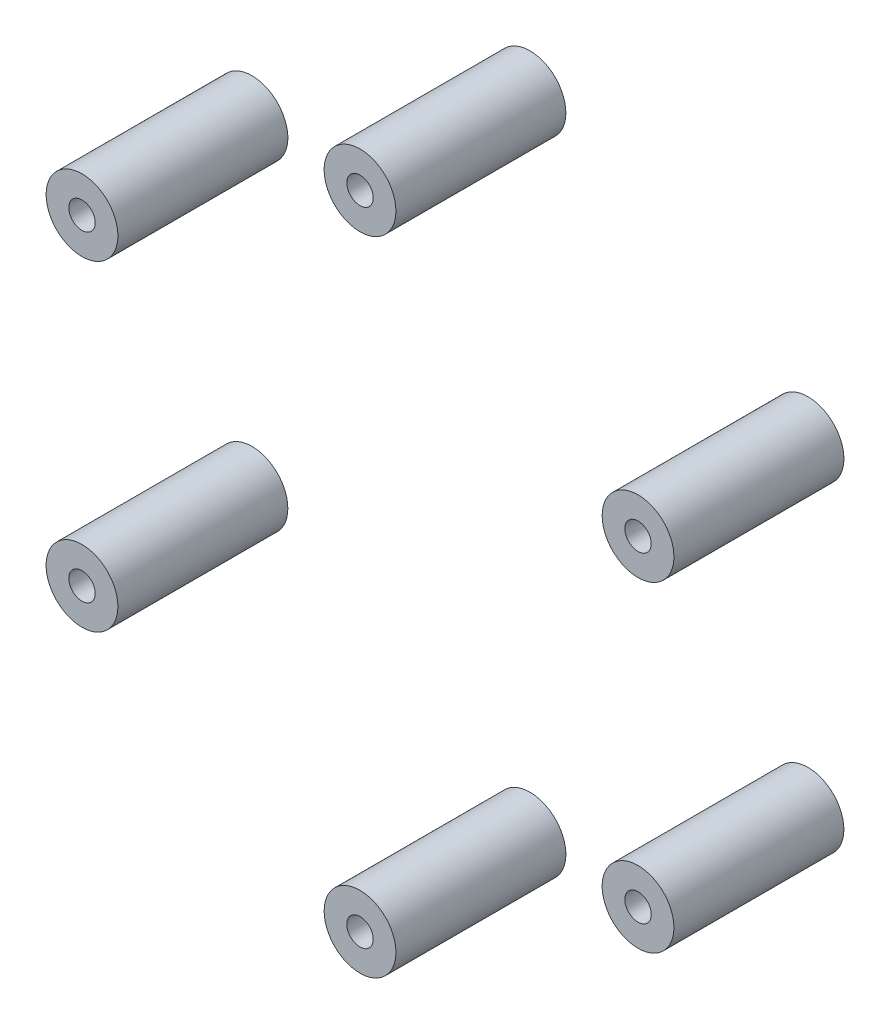
ISO-10303-21;
HEADER;
FILE_DESCRIPTION(('STEP AP214'),'2;1');
FILE_NAME('part.step','',(''),(''),'','','');
FILE_SCHEMA(('AUTOMOTIVE_DESIGN { 1 0 10303 214 1 1 1 1 }'));
ENDSEC;
DATA;
#1=APPLICATION_CONTEXT('core data for automotive mechanical design processes');
#2=APPLICATION_PROTOCOL_DEFINITION('international standard','automotive_design',2000,#1);
#3=PRODUCT_CONTEXT('',#1,'mechanical');
#4=PRODUCT('Part','Part','',(#3));
#5=PRODUCT_RELATED_PRODUCT_CATEGORY('part','',(#4));
#6=PRODUCT_DEFINITION_FORMATION('','',#4);
#7=PRODUCT_DEFINITION_CONTEXT('part definition',#1,'design');
#8=PRODUCT_DEFINITION('design','',#6,#7);
#9=PRODUCT_DEFINITION_SHAPE('','',#8);
#10=(LENGTH_UNIT() NAMED_UNIT(*) SI_UNIT(.MILLI.,.METRE.));
#11=(NAMED_UNIT(*) PLANE_ANGLE_UNIT() SI_UNIT($,.RADIAN.));
#12=(NAMED_UNIT(*) SI_UNIT($,.STERADIAN.) SOLID_ANGLE_UNIT());
#13=UNCERTAINTY_MEASURE_WITH_UNIT(LENGTH_MEASURE(1.E-05),#10,'distance_accuracy_value','');
#14=(GEOMETRIC_REPRESENTATION_CONTEXT(3) GLOBAL_UNCERTAINTY_ASSIGNED_CONTEXT((#13)) GLOBAL_UNIT_ASSIGNED_CONTEXT((#10,
#11,#12)) REPRESENTATION_CONTEXT('',''));
#15=CARTESIAN_POINT('',(0.,0.,0.));
#16=DIRECTION('',(0.,0.,1.));
#17=DIRECTION('',(1.,0.,0.));
#18=AXIS2_PLACEMENT_3D('',#15,#16,#17);
#19=CARTESIAN_POINT('',(29.4448637286707,17.0000000000003,9.));
#20=DIRECTION('',(0.,0.,1.));
#21=DIRECTION('',(0.50000000000001,-0.866025403784433,0.));
#22=AXIS2_PLACEMENT_3D('',#19,#20,#21);
#23=PLANE('',#22);
#24=CARTESIAN_POINT('',(29.4448637286707,17.0000000000003,9.));
#25=DIRECTION('',(0.,0.,1.));
#26=DIRECTION('',(0.50000000000001,-0.866025403784433,0.));
#27=AXIS2_PLACEMENT_3D('',#24,#25,#26);
#28=CIRCLE('',#27,3.8);
#29=CARTESIAN_POINT('',(31.3448637286708,13.7091034656195,9.));
#30=VERTEX_POINT('',#29);
#31=EDGE_CURVE('E11',#30,#30,#28,.T.);
#32=ORIENTED_EDGE('',*,*,#31,.T.);
#33=EDGE_LOOP('',(#32));
#34=FACE_BOUND('',#33,.T.);
#35=CARTESIAN_POINT('',(29.4448637286707,17.0000000000003,9.));
#36=DIRECTION('',(0.,0.,1.));
#37=DIRECTION('',(0.50000000000001,-0.866025403784433,0.));
#38=AXIS2_PLACEMENT_3D('',#35,#36,#37);
#39=CIRCLE('',#38,1.4);
#40=CARTESIAN_POINT('',(30.1448637286707,15.7875644347021,9.));
#41=VERTEX_POINT('',#40);
#42=EDGE_CURVE('E51',#41,#41,#39,.T.);
#43=ORIENTED_EDGE('',*,*,#42,.F.);
#44=EDGE_LOOP('',(#43));
#45=FACE_BOUND('',#44,.T.);
#46=ADVANCED_FACE('F40',(#34,#45),#23,.T.);
#47=CARTESIAN_POINT('',(29.4448637286707,17.0000000000003,-9.));
#48=DIRECTION('',(0.,0.,1.));
#49=DIRECTION('',(0.50000000000001,-0.866025403784433,0.));
#50=AXIS2_PLACEMENT_3D('',#47,#48,#49);
#51=PLANE('',#50);
#52=CARTESIAN_POINT('',(29.4448637286707,17.0000000000003,-9.));
#53=DIRECTION('',(0.,0.,1.));
#54=DIRECTION('',(0.50000000000001,-0.866025403784433,0.));
#55=AXIS2_PLACEMENT_3D('',#52,#53,#54);
#56=CIRCLE('',#55,3.8);
#57=CARTESIAN_POINT('',(31.3448637286708,13.7091034656195,-9.));
#58=VERTEX_POINT('',#57);
#59=EDGE_CURVE('E44',#58,#58,#56,.T.);
#60=ORIENTED_EDGE('',*,*,#59,.F.);
#61=EDGE_LOOP('',(#60));
#62=FACE_BOUND('',#61,.T.);
#63=CARTESIAN_POINT('',(29.4448637286707,17.0000000000003,-9.));
#64=DIRECTION('',(0.,0.,1.));
#65=DIRECTION('',(0.50000000000001,-0.866025403784433,0.));
#66=AXIS2_PLACEMENT_3D('',#63,#64,#65);
#67=CIRCLE('',#66,1.4);
#68=CARTESIAN_POINT('',(30.1448637286707,15.7875644347021,-9.));
#69=VERTEX_POINT('',#68);
#70=EDGE_CURVE('E53',#69,#69,#67,.T.);
#71=ORIENTED_EDGE('',*,*,#70,.T.);
#72=EDGE_LOOP('',(#71));
#73=FACE_BOUND('',#72,.T.);
#74=ADVANCED_FACE('F63',(#62,#73),#51,.F.);
#75=CARTESIAN_POINT('',(29.4448637286707,17.0000000000003,9.));
#76=DIRECTION('',(0.,0.,-1.));
#77=DIRECTION('',(-0.50000000000001,0.866025403784433,0.));
#78=AXIS2_PLACEMENT_3D('',#75,#76,#77);
#79=CYLINDRICAL_SURFACE('',#78,3.8);
#80=ORIENTED_EDGE('',*,*,#31,.F.);
#81=EDGE_LOOP('',(#80));
#82=FACE_BOUND('',#81,.T.);
#83=ORIENTED_EDGE('',*,*,#59,.T.);
#84=EDGE_LOOP('',(#83));
#85=FACE_BOUND('',#84,.T.);
#86=ADVANCED_FACE('F42',(#82,#85),#79,.T.);
#87=CARTESIAN_POINT('',(29.4448637286707,17.0000000000003,9.));
#88=DIRECTION('',(0.,0.,-1.));
#89=DIRECTION('',(-0.50000000000001,0.866025403784433,0.));
#90=AXIS2_PLACEMENT_3D('',#87,#88,#89);
#91=CYLINDRICAL_SURFACE('',#90,1.4);
#92=ORIENTED_EDGE('',*,*,#42,.T.);
#93=EDGE_LOOP('',(#92));
#94=FACE_BOUND('',#93,.T.);
#95=ORIENTED_EDGE('',*,*,#70,.F.);
#96=EDGE_LOOP('',(#95));
#97=FACE_BOUND('',#96,.T.);
#98=ADVANCED_FACE('F59',(#94,#97),#91,.F.);
#99=CLOSED_SHELL('',(#46,#74,#86,#98));
#100=MANIFOLD_SOLID_BREP('B2',#99);
#101=CARTESIAN_POINT('',(29.4448637286711,-16.9999999999997,9.));
#102=DIRECTION('',(0.,0.,1.));
#103=DIRECTION('',(-0.499999999999992,-0.866025403784443,0.));
#104=AXIS2_PLACEMENT_3D('',#101,#102,#103);
#105=PLANE('',#104);
#106=CARTESIAN_POINT('',(29.4448637286711,-16.9999999999997,9.));
#107=DIRECTION('',(0.,0.,1.));
#108=DIRECTION('',(-0.499999999999992,-0.866025403784443,0.));
#109=AXIS2_PLACEMENT_3D('',#106,#107,#108);
#110=CIRCLE('',#109,3.8);
#111=CARTESIAN_POINT('',(27.5448637286711,-20.2908965343806,9.));
#112=VERTEX_POINT('',#111);
#113=EDGE_CURVE('E39',#112,#112,#110,.T.);
#114=ORIENTED_EDGE('',*,*,#113,.T.);
#115=EDGE_LOOP('',(#114));
#116=FACE_BOUND('',#115,.T.);
#117=CARTESIAN_POINT('',(29.4448637286711,-16.9999999999997,9.));
#118=DIRECTION('',(0.,0.,1.));
#119=DIRECTION('',(-0.499999999999992,-0.866025403784443,0.));
#120=AXIS2_PLACEMENT_3D('',#117,#118,#119);
#121=CIRCLE('',#120,1.4);
#122=CARTESIAN_POINT('',(28.7448637286711,-18.212435565298,9.));
#123=VERTEX_POINT('',#122);
#124=EDGE_CURVE('E121',#123,#123,#121,.T.);
#125=ORIENTED_EDGE('',*,*,#124,.F.);
#126=EDGE_LOOP('',(#125));
#127=FACE_BOUND('',#126,.T.);
#128=ADVANCED_FACE('F110',(#116,#127),#105,.T.);
#129=CARTESIAN_POINT('',(29.4448637286711,-16.9999999999997,-9.));
#130=DIRECTION('',(0.,0.,1.));
#131=DIRECTION('',(-0.499999999999992,-0.866025403784443,0.));
#132=AXIS2_PLACEMENT_3D('',#129,#130,#131);
#133=PLANE('',#132);
#134=CARTESIAN_POINT('',(29.4448637286711,-16.9999999999997,-9.));
#135=DIRECTION('',(0.,0.,1.));
#136=DIRECTION('',(-0.499999999999992,-0.866025403784443,0.));
#137=AXIS2_PLACEMENT_3D('',#134,#135,#136);
#138=CIRCLE('',#137,3.8);
#139=CARTESIAN_POINT('',(27.5448637286711,-20.2908965343806,-9.));
#140=VERTEX_POINT('',#139);
#141=EDGE_CURVE('E114',#140,#140,#138,.T.);
#142=ORIENTED_EDGE('',*,*,#141,.F.);
#143=EDGE_LOOP('',(#142));
#144=FACE_BOUND('',#143,.T.);
#145=CARTESIAN_POINT('',(29.4448637286711,-16.9999999999997,-9.));
#146=DIRECTION('',(0.,0.,1.));
#147=DIRECTION('',(-0.499999999999992,-0.866025403784443,0.));
#148=AXIS2_PLACEMENT_3D('',#145,#146,#147);
#149=CIRCLE('',#148,1.4);
#150=CARTESIAN_POINT('',(28.7448637286711,-18.212435565298,-9.));
#151=VERTEX_POINT('',#150);
#152=EDGE_CURVE('E123',#151,#151,#149,.T.);
#153=ORIENTED_EDGE('',*,*,#152,.T.);
#154=EDGE_LOOP('',(#153));
#155=FACE_BOUND('',#154,.T.);
#156=ADVANCED_FACE('F133',(#144,#155),#133,.F.);
#157=CARTESIAN_POINT('',(29.4448637286711,-16.9999999999997,9.));
#158=DIRECTION('',(0.,0.,-1.));
#159=DIRECTION('',(0.499999999999992,0.866025403784443,0.));
#160=AXIS2_PLACEMENT_3D('',#157,#158,#159);
#161=CYLINDRICAL_SURFACE('',#160,3.8);
#162=ORIENTED_EDGE('',*,*,#113,.F.);
#163=EDGE_LOOP('',(#162));
#164=FACE_BOUND('',#163,.T.);
#165=ORIENTED_EDGE('',*,*,#141,.T.);
#166=EDGE_LOOP('',(#165));
#167=FACE_BOUND('',#166,.T.);
#168=ADVANCED_FACE('F112',(#164,#167),#161,.T.);
#169=CARTESIAN_POINT('',(29.4448637286711,-16.9999999999997,9.));
#170=DIRECTION('',(0.,0.,-1.));
#171=DIRECTION('',(0.499999999999992,0.866025403784443,0.));
#172=AXIS2_PLACEMENT_3D('',#169,#170,#171);
#173=CYLINDRICAL_SURFACE('',#172,1.4);
#174=ORIENTED_EDGE('',*,*,#124,.T.);
#175=EDGE_LOOP('',(#174));
#176=FACE_BOUND('',#175,.T.);
#177=ORIENTED_EDGE('',*,*,#152,.F.);
#178=EDGE_LOOP('',(#177));
#179=FACE_BOUND('',#178,.T.);
#180=ADVANCED_FACE('F129',(#176,#179),#173,.F.);
#181=CLOSED_SHELL('',(#128,#156,#168,#180));
#182=MANIFOLD_SOLID_BREP('B6',#181);
#183=CARTESIAN_POINT('',(0.,-34.,9.));
#184=DIRECTION('',(0.,0.,1.));
#185=DIRECTION('',(-1.,0.,0.));
#186=AXIS2_PLACEMENT_3D('',#183,#184,#185);
#187=PLANE('',#186);
#188=CARTESIAN_POINT('',(0.,-34.,9.));
#189=DIRECTION('',(0.,0.,1.));
#190=DIRECTION('',(-1.,0.,0.));
#191=AXIS2_PLACEMENT_3D('',#188,#189,#190);
#192=CIRCLE('',#191,3.8);
#193=CARTESIAN_POINT('',(-3.80000000000001,-34.,9.));
#194=VERTEX_POINT('',#193);
#195=EDGE_CURVE('E109',#194,#194,#192,.T.);
#196=ORIENTED_EDGE('',*,*,#195,.T.);
#197=EDGE_LOOP('',(#196));
#198=FACE_BOUND('',#197,.T.);
#199=CARTESIAN_POINT('',(0.,-34.,9.));
#200=DIRECTION('',(0.,0.,1.));
#201=DIRECTION('',(-1.,0.,0.));
#202=AXIS2_PLACEMENT_3D('',#199,#200,#201);
#203=CIRCLE('',#202,1.4);
#204=CARTESIAN_POINT('',(-1.40000000000001,-34.,9.));
#205=VERTEX_POINT('',#204);
#206=EDGE_CURVE('E191',#205,#205,#203,.T.);
#207=ORIENTED_EDGE('',*,*,#206,.F.);
#208=EDGE_LOOP('',(#207));
#209=FACE_BOUND('',#208,.T.);
#210=ADVANCED_FACE('F180',(#198,#209),#187,.T.);
#211=CARTESIAN_POINT('',(0.,-34.,-9.));
#212=DIRECTION('',(0.,0.,1.));
#213=DIRECTION('',(-1.,0.,0.));
#214=AXIS2_PLACEMENT_3D('',#211,#212,#213);
#215=PLANE('',#214);
#216=CARTESIAN_POINT('',(0.,-34.,-9.));
#217=DIRECTION('',(0.,0.,1.));
#218=DIRECTION('',(-1.,0.,0.));
#219=AXIS2_PLACEMENT_3D('',#216,#217,#218);
#220=CIRCLE('',#219,3.8);
#221=CARTESIAN_POINT('',(-3.80000000000001,-34.,-9.));
#222=VERTEX_POINT('',#221);
#223=EDGE_CURVE('E184',#222,#222,#220,.T.);
#224=ORIENTED_EDGE('',*,*,#223,.F.);
#225=EDGE_LOOP('',(#224));
#226=FACE_BOUND('',#225,.T.);
#227=CARTESIAN_POINT('',(0.,-34.,-9.));
#228=DIRECTION('',(0.,0.,1.));
#229=DIRECTION('',(-1.,0.,0.));
#230=AXIS2_PLACEMENT_3D('',#227,#228,#229);
#231=CIRCLE('',#230,1.4);
#232=CARTESIAN_POINT('',(-1.40000000000001,-34.,-9.));
#233=VERTEX_POINT('',#232);
#234=EDGE_CURVE('E193',#233,#233,#231,.T.);
#235=ORIENTED_EDGE('',*,*,#234,.T.);
#236=EDGE_LOOP('',(#235));
#237=FACE_BOUND('',#236,.T.);
#238=ADVANCED_FACE('F203',(#226,#237),#215,.F.);
#239=CARTESIAN_POINT('',(0.,-34.,9.));
#240=DIRECTION('',(0.,0.,-1.));
#241=DIRECTION('',(1.,0.,0.));
#242=AXIS2_PLACEMENT_3D('',#239,#240,#241);
#243=CYLINDRICAL_SURFACE('',#242,3.8);
#244=ORIENTED_EDGE('',*,*,#195,.F.);
#245=EDGE_LOOP('',(#244));
#246=FACE_BOUND('',#245,.T.);
#247=ORIENTED_EDGE('',*,*,#223,.T.);
#248=EDGE_LOOP('',(#247));
#249=FACE_BOUND('',#248,.T.);
#250=ADVANCED_FACE('F182',(#246,#249),#243,.T.);
#251=CARTESIAN_POINT('',(0.,-34.,9.));
#252=DIRECTION('',(0.,0.,-1.));
#253=DIRECTION('',(1.,0.,0.));
#254=AXIS2_PLACEMENT_3D('',#251,#252,#253);
#255=CYLINDRICAL_SURFACE('',#254,1.4);
#256=ORIENTED_EDGE('',*,*,#206,.T.);
#257=EDGE_LOOP('',(#256));
#258=FACE_BOUND('',#257,.T.);
#259=ORIENTED_EDGE('',*,*,#234,.F.);
#260=EDGE_LOOP('',(#259));
#261=FACE_BOUND('',#260,.T.);
#262=ADVANCED_FACE('F199',(#258,#261),#255,.F.);
#263=CLOSED_SHELL('',(#210,#238,#250,#262));
#264=MANIFOLD_SOLID_BREP('B34',#263);
#265=CARTESIAN_POINT('',(-29.4448637286708,-17.0000000000001,9.));
#266=DIRECTION('',(0.,0.,1.));
#267=DIRECTION('',(-0.500000000000004,0.866025403784436,0.));
#268=AXIS2_PLACEMENT_3D('',#265,#266,#267);
#269=PLANE('',#268);
#270=CARTESIAN_POINT('',(-29.4448637286708,-17.0000000000001,9.));
#271=DIRECTION('',(0.,0.,1.));
#272=DIRECTION('',(-0.500000000000004,0.866025403784436,0.));
#273=AXIS2_PLACEMENT_3D('',#270,#271,#272);
#274=CIRCLE('',#273,3.8);
#275=CARTESIAN_POINT('',(-31.3448637286709,-13.7091034656193,9.));
#276=VERTEX_POINT('',#275);
#277=EDGE_CURVE('E179',#276,#276,#274,.T.);
#278=ORIENTED_EDGE('',*,*,#277,.T.);
#279=EDGE_LOOP('',(#278));
#280=FACE_BOUND('',#279,.T.);
#281=CARTESIAN_POINT('',(-29.4448637286708,-17.0000000000001,9.));
#282=DIRECTION('',(0.,0.,1.));
#283=DIRECTION('',(-0.500000000000004,0.866025403784436,0.));
#284=AXIS2_PLACEMENT_3D('',#281,#282,#283);
#285=CIRCLE('',#284,1.4);
#286=CARTESIAN_POINT('',(-30.1448637286709,-15.7875644347019,9.));
#287=VERTEX_POINT('',#286);
#288=EDGE_CURVE('E261',#287,#287,#285,.T.);
#289=ORIENTED_EDGE('',*,*,#288,.F.);
#290=EDGE_LOOP('',(#289));
#291=FACE_BOUND('',#290,.T.);
#292=ADVANCED_FACE('F250',(#280,#291),#269,.T.);
#293=CARTESIAN_POINT('',(-29.4448637286708,-17.0000000000001,-9.));
#294=DIRECTION('',(0.,0.,1.));
#295=DIRECTION('',(-0.500000000000004,0.866025403784436,0.));
#296=AXIS2_PLACEMENT_3D('',#293,#294,#295);
#297=PLANE('',#296);
#298=CARTESIAN_POINT('',(-29.4448637286708,-17.0000000000001,-9.));
#299=DIRECTION('',(0.,0.,1.));
#300=DIRECTION('',(-0.500000000000004,0.866025403784436,0.));
#301=AXIS2_PLACEMENT_3D('',#298,#299,#300);
#302=CIRCLE('',#301,3.8);
#303=CARTESIAN_POINT('',(-31.3448637286709,-13.7091034656193,-9.));
#304=VERTEX_POINT('',#303);
#305=EDGE_CURVE('E254',#304,#304,#302,.T.);
#306=ORIENTED_EDGE('',*,*,#305,.F.);
#307=EDGE_LOOP('',(#306));
#308=FACE_BOUND('',#307,.T.);
#309=CARTESIAN_POINT('',(-29.4448637286708,-17.0000000000001,-9.));
#310=DIRECTION('',(0.,0.,1.));
#311=DIRECTION('',(-0.500000000000004,0.866025403784436,0.));
#312=AXIS2_PLACEMENT_3D('',#309,#310,#311);
#313=CIRCLE('',#312,1.4);
#314=CARTESIAN_POINT('',(-30.1448637286709,-15.7875644347019,-9.));
#315=VERTEX_POINT('',#314);
#316=EDGE_CURVE('E263',#315,#315,#313,.T.);
#317=ORIENTED_EDGE('',*,*,#316,.T.);
#318=EDGE_LOOP('',(#317));
#319=FACE_BOUND('',#318,.T.);
#320=ADVANCED_FACE('F273',(#308,#319),#297,.F.);
#321=CARTESIAN_POINT('',(-29.4448637286708,-17.0000000000001,9.));
#322=DIRECTION('',(0.,0.,-1.));
#323=DIRECTION('',(0.500000000000004,-0.866025403784436,0.));
#324=AXIS2_PLACEMENT_3D('',#321,#322,#323);
#325=CYLINDRICAL_SURFACE('',#324,3.8);
#326=ORIENTED_EDGE('',*,*,#277,.F.);
#327=EDGE_LOOP('',(#326));
#328=FACE_BOUND('',#327,.T.);
#329=ORIENTED_EDGE('',*,*,#305,.T.);
#330=EDGE_LOOP('',(#329));
#331=FACE_BOUND('',#330,.T.);
#332=ADVANCED_FACE('F252',(#328,#331),#325,.T.);
#333=CARTESIAN_POINT('',(-29.4448637286708,-17.0000000000001,9.));
#334=DIRECTION('',(0.,0.,-1.));
#335=DIRECTION('',(0.500000000000004,-0.866025403784436,0.));
#336=AXIS2_PLACEMENT_3D('',#333,#334,#335);
#337=CYLINDRICAL_SURFACE('',#336,1.4);
#338=ORIENTED_EDGE('',*,*,#288,.T.);
#339=EDGE_LOOP('',(#338));
#340=FACE_BOUND('',#339,.T.);
#341=ORIENTED_EDGE('',*,*,#316,.F.);
#342=EDGE_LOOP('',(#341));
#343=FACE_BOUND('',#342,.T.);
#344=ADVANCED_FACE('F269',(#340,#343),#337,.F.);
#345=CLOSED_SHELL('',(#292,#320,#332,#344));
#346=MANIFOLD_SOLID_BREP('B104',#345);
#347=CARTESIAN_POINT('',(-29.4448637286709,16.9999999999999,9.));
#348=DIRECTION('',(0.,0.,1.));
#349=DIRECTION('',(0.499999999999998,0.86602540378444,0.));
#350=AXIS2_PLACEMENT_3D('',#347,#348,#349);
#351=PLANE('',#350);
#352=CARTESIAN_POINT('',(-29.4448637286709,16.9999999999999,9.));
#353=DIRECTION('',(0.,0.,1.));
#354=DIRECTION('',(0.499999999999998,0.86602540378444,0.));
#355=AXIS2_PLACEMENT_3D('',#352,#353,#354);
#356=CIRCLE('',#355,3.8);
#357=CARTESIAN_POINT('',(-27.544863728671,20.2908965343808,9.));
#358=VERTEX_POINT('',#357);
#359=EDGE_CURVE('E249',#358,#358,#356,.T.);
#360=ORIENTED_EDGE('',*,*,#359,.T.);
#361=EDGE_LOOP('',(#360));
#362=FACE_BOUND('',#361,.T.);
#363=CARTESIAN_POINT('',(-29.4448637286709,16.9999999999999,9.));
#364=DIRECTION('',(0.,0.,1.));
#365=DIRECTION('',(0.499999999999998,0.86602540378444,0.));
#366=AXIS2_PLACEMENT_3D('',#363,#364,#365);
#367=CIRCLE('',#366,1.4);
#368=CARTESIAN_POINT('',(-28.744863728671,18.2124355652982,9.));
#369=VERTEX_POINT('',#368);
#370=EDGE_CURVE('E330',#369,#369,#367,.T.);
#371=ORIENTED_EDGE('',*,*,#370,.F.);
#372=EDGE_LOOP('',(#371));
#373=FACE_BOUND('',#372,.T.);
#374=ADVANCED_FACE('F319',(#362,#373),#351,.T.);
#375=CARTESIAN_POINT('',(-29.4448637286709,16.9999999999999,-9.));
#376=DIRECTION('',(0.,0.,1.));
#377=DIRECTION('',(0.499999999999998,0.86602540378444,0.));
#378=AXIS2_PLACEMENT_3D('',#375,#376,#377);
#379=PLANE('',#378);
#380=CARTESIAN_POINT('',(-29.4448637286709,16.9999999999999,-9.));
#381=DIRECTION('',(0.,0.,1.));
#382=DIRECTION('',(0.499999999999998,0.86602540378444,0.));
#383=AXIS2_PLACEMENT_3D('',#380,#381,#382);
#384=CIRCLE('',#383,3.8);
#385=CARTESIAN_POINT('',(-27.544863728671,20.2908965343808,-9.));
#386=VERTEX_POINT('',#385);
#387=EDGE_CURVE('E323',#386,#386,#384,.T.);
#388=ORIENTED_EDGE('',*,*,#387,.F.);
#389=EDGE_LOOP('',(#388));
#390=FACE_BOUND('',#389,.T.);
#391=CARTESIAN_POINT('',(-29.4448637286709,16.9999999999999,-9.));
#392=DIRECTION('',(0.,0.,1.));
#393=DIRECTION('',(0.499999999999998,0.86602540378444,0.));
#394=AXIS2_PLACEMENT_3D('',#391,#392,#393);
#395=CIRCLE('',#394,1.4);
#396=CARTESIAN_POINT('',(-28.744863728671,18.2124355652982,-9.));
#397=VERTEX_POINT('',#396);
#398=EDGE_CURVE('E332',#397,#397,#395,.T.);
#399=ORIENTED_EDGE('',*,*,#398,.T.);
#400=EDGE_LOOP('',(#399));
#401=FACE_BOUND('',#400,.T.);
#402=ADVANCED_FACE('F342',(#390,#401),#379,.F.);
#403=CARTESIAN_POINT('',(-29.4448637286709,16.9999999999999,9.));
#404=DIRECTION('',(0.,0.,-1.));
#405=DIRECTION('',(-0.499999999999998,-0.86602540378444,0.));
#406=AXIS2_PLACEMENT_3D('',#403,#404,#405);
#407=CYLINDRICAL_SURFACE('',#406,3.8);
#408=ORIENTED_EDGE('',*,*,#359,.F.);
#409=EDGE_LOOP('',(#408));
#410=FACE_BOUND('',#409,.T.);
#411=ORIENTED_EDGE('',*,*,#387,.T.);
#412=EDGE_LOOP('',(#411));
#413=FACE_BOUND('',#412,.T.);
#414=ADVANCED_FACE('F321',(#410,#413),#407,.T.);
#415=CARTESIAN_POINT('',(-29.4448637286709,16.9999999999999,9.));
#416=DIRECTION('',(0.,0.,-1.));
#417=DIRECTION('',(-0.499999999999998,-0.86602540378444,0.));
#418=AXIS2_PLACEMENT_3D('',#415,#416,#417);
#419=CYLINDRICAL_SURFACE('',#418,1.4);
#420=ORIENTED_EDGE('',*,*,#370,.T.);
#421=EDGE_LOOP('',(#420));
#422=FACE_BOUND('',#421,.T.);
#423=ORIENTED_EDGE('',*,*,#398,.F.);
#424=EDGE_LOOP('',(#423));
#425=FACE_BOUND('',#424,.T.);
#426=ADVANCED_FACE('F338',(#422,#425),#419,.F.);
#427=CLOSED_SHELL('',(#374,#402,#414,#426));
#428=MANIFOLD_SOLID_BREP('B174',#427);
#429=CARTESIAN_POINT('',(0.,34.,9.));
#430=DIRECTION('',(0.,0.,1.));
#431=DIRECTION('',(1.,0.,0.));
#432=AXIS2_PLACEMENT_3D('',#429,#430,#431);
#433=PLANE('',#432);
#434=CARTESIAN_POINT('',(0.,34.,9.));
#435=DIRECTION('',(0.,0.,1.));
#436=DIRECTION('',(1.,0.,0.));
#437=AXIS2_PLACEMENT_3D('',#434,#435,#436);
#438=CIRCLE('',#437,3.8);
#439=CARTESIAN_POINT('',(3.80000000000001,34.,9.));
#440=VERTEX_POINT('',#439);
#441=EDGE_CURVE('E318',#440,#440,#438,.T.);
#442=ORIENTED_EDGE('',*,*,#441,.T.);
#443=EDGE_LOOP('',(#442));
#444=FACE_BOUND('',#443,.T.);
#445=CARTESIAN_POINT('',(0.,34.,9.));
#446=DIRECTION('',(0.,0.,1.));
#447=DIRECTION('',(1.,0.,0.));
#448=AXIS2_PLACEMENT_3D('',#445,#446,#447);
#449=CIRCLE('',#448,1.4);
#450=CARTESIAN_POINT('',(1.40000000000001,34.,9.));
#451=VERTEX_POINT('',#450);
#452=EDGE_CURVE('E392',#451,#451,#449,.T.);
#453=ORIENTED_EDGE('',*,*,#452,.F.);
#454=EDGE_LOOP('',(#453));
#455=FACE_BOUND('',#454,.T.);
#456=ADVANCED_FACE('F381',(#444,#455),#433,.T.);
#457=CARTESIAN_POINT('',(0.,34.,-9.));
#458=DIRECTION('',(0.,0.,1.));
#459=DIRECTION('',(1.,0.,0.));
#460=AXIS2_PLACEMENT_3D('',#457,#458,#459);
#461=PLANE('',#460);
#462=CARTESIAN_POINT('',(0.,34.,-9.));
#463=DIRECTION('',(0.,0.,1.));
#464=DIRECTION('',(1.,0.,0.));
#465=AXIS2_PLACEMENT_3D('',#462,#463,#464);
#466=CIRCLE('',#465,3.8);
#467=CARTESIAN_POINT('',(3.80000000000001,34.,-9.));
#468=VERTEX_POINT('',#467);
#469=EDGE_CURVE('E385',#468,#468,#466,.T.);
#470=ORIENTED_EDGE('',*,*,#469,.F.);
#471=EDGE_LOOP('',(#470));
#472=FACE_BOUND('',#471,.T.);
#473=CARTESIAN_POINT('',(0.,34.,-9.));
#474=DIRECTION('',(0.,0.,1.));
#475=DIRECTION('',(1.,0.,0.));
#476=AXIS2_PLACEMENT_3D('',#473,#474,#475);
#477=CIRCLE('',#476,1.4);
#478=CARTESIAN_POINT('',(1.40000000000001,34.,-9.));
#479=VERTEX_POINT('',#478);
#480=EDGE_CURVE('E394',#479,#479,#477,.T.);
#481=ORIENTED_EDGE('',*,*,#480,.T.);
#482=EDGE_LOOP('',(#481));
#483=FACE_BOUND('',#482,.T.);
#484=ADVANCED_FACE('F404',(#472,#483),#461,.F.);
#485=CARTESIAN_POINT('',(0.,34.,9.));
#486=DIRECTION('',(0.,0.,-1.));
#487=DIRECTION('',(-1.,0.,0.));
#488=AXIS2_PLACEMENT_3D('',#485,#486,#487);
#489=CYLINDRICAL_SURFACE('',#488,3.8);
#490=ORIENTED_EDGE('',*,*,#441,.F.);
#491=EDGE_LOOP('',(#490));
#492=FACE_BOUND('',#491,.T.);
#493=ORIENTED_EDGE('',*,*,#469,.T.);
#494=EDGE_LOOP('',(#493));
#495=FACE_BOUND('',#494,.T.);
#496=ADVANCED_FACE('F383',(#492,#495),#489,.T.);
#497=CARTESIAN_POINT('',(0.,34.,9.));
#498=DIRECTION('',(0.,0.,-1.));
#499=DIRECTION('',(-1.,0.,0.));
#500=AXIS2_PLACEMENT_3D('',#497,#498,#499);
#501=CYLINDRICAL_SURFACE('',#500,1.4);
#502=ORIENTED_EDGE('',*,*,#452,.T.);
#503=EDGE_LOOP('',(#502));
#504=FACE_BOUND('',#503,.T.);
#505=ORIENTED_EDGE('',*,*,#480,.F.);
#506=EDGE_LOOP('',(#505));
#507=FACE_BOUND('',#506,.T.);
#508=ADVANCED_FACE('F400',(#504,#507),#501,.F.);
#509=CLOSED_SHELL('',(#456,#484,#496,#508));
#510=MANIFOLD_SOLID_BREP('B244',#509);
#511=ADVANCED_BREP_SHAPE_REPRESENTATION('',(#18,#100,#182,#264,#346,#428,#510),#14);
#512=SHAPE_DEFINITION_REPRESENTATION(#9,#511);
ENDSEC;
END-ISO-10303-21;
